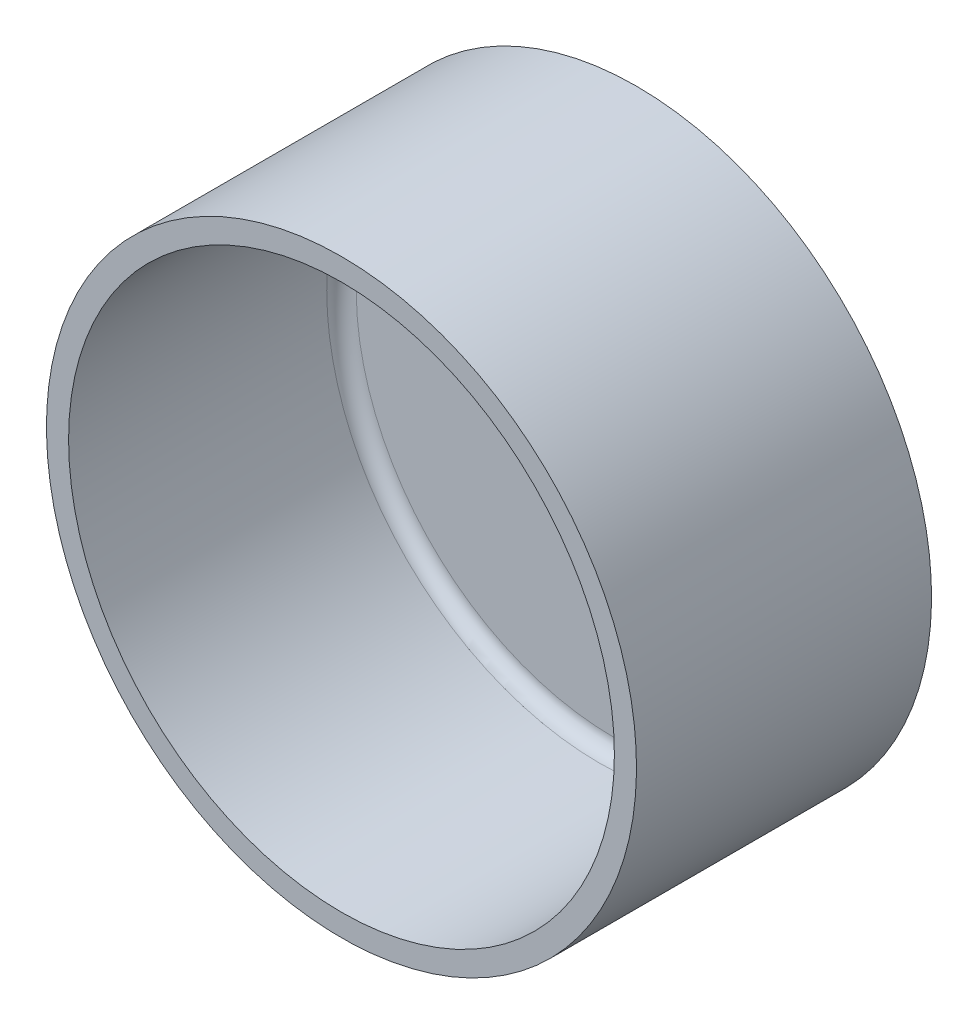
ISO-10303-21;
HEADER;
FILE_DESCRIPTION(('STEP AP214'),'2;1');
FILE_NAME('part.step','',(''),(''),'','','');
FILE_SCHEMA(('AUTOMOTIVE_DESIGN { 1 0 10303 214 1 1 1 1 }'));
ENDSEC;
DATA;
#1=APPLICATION_CONTEXT('core data for automotive mechanical design processes');
#2=APPLICATION_PROTOCOL_DEFINITION('international standard','automotive_design',2000,#1);
#3=PRODUCT_CONTEXT('',#1,'mechanical');
#4=PRODUCT('Part','Part','',(#3));
#5=PRODUCT_RELATED_PRODUCT_CATEGORY('part','',(#4));
#6=PRODUCT_DEFINITION_FORMATION('','',#4);
#7=PRODUCT_DEFINITION_CONTEXT('part definition',#1,'design');
#8=PRODUCT_DEFINITION('design','',#6,#7);
#9=PRODUCT_DEFINITION_SHAPE('','',#8);
#10=(LENGTH_UNIT() NAMED_UNIT(*) SI_UNIT(.MILLI.,.METRE.));
#11=(NAMED_UNIT(*) PLANE_ANGLE_UNIT() SI_UNIT($,.RADIAN.));
#12=(NAMED_UNIT(*) SI_UNIT($,.STERADIAN.) SOLID_ANGLE_UNIT());
#13=UNCERTAINTY_MEASURE_WITH_UNIT(LENGTH_MEASURE(1.E-05),#10,'distance_accuracy_value','');
#14=(GEOMETRIC_REPRESENTATION_CONTEXT(3) GLOBAL_UNCERTAINTY_ASSIGNED_CONTEXT((#13)) GLOBAL_UNIT_ASSIGNED_CONTEXT((#10,
#11,#12)) REPRESENTATION_CONTEXT('',''));
#15=CARTESIAN_POINT('',(0.,0.,0.));
#16=DIRECTION('',(0.,0.,1.));
#17=DIRECTION('',(1.,0.,0.));
#18=AXIS2_PLACEMENT_3D('',#15,#16,#17);
#19=CARTESIAN_POINT('',(0.,18.5,0.));
#20=DIRECTION('',(0.,0.,1.));
#21=DIRECTION('',(0.,-1.,0.));
#22=AXIS2_PLACEMENT_3D('',#19,#20,#21);
#23=PLANE('',#22);
#24=CARTESIAN_POINT('',(0.,0.,0.));
#25=DIRECTION('',(0.,0.,-1.));
#26=DIRECTION('',(0.,1.,0.));
#27=AXIS2_PLACEMENT_3D('',#24,#25,#26);
#28=CIRCLE('',#27,18.5);
#29=CARTESIAN_POINT('',(0.,18.5,0.));
#30=VERTEX_POINT('',#29);
#31=EDGE_CURVE('E131',#30,#30,#28,.T.);
#32=ORIENTED_EDGE('',*,*,#31,.T.);
#33=EDGE_LOOP('',(#32));
#34=FACE_BOUND('',#33,.T.);
#35=CARTESIAN_POINT('',(0.,0.,0.));
#36=DIRECTION('',(0.,0.,-1.));
#37=DIRECTION('',(0.,1.,0.));
#38=AXIS2_PLACEMENT_3D('',#35,#36,#37);
#39=CIRCLE('',#38,20.);
#40=CARTESIAN_POINT('',(0.,20.,0.));
#41=VERTEX_POINT('',#40);
#42=EDGE_CURVE('E122',#41,#41,#39,.T.);
#43=ORIENTED_EDGE('',*,*,#42,.F.);
#44=EDGE_LOOP('',(#43));
#45=FACE_BOUND('',#44,.T.);
#46=ADVANCED_FACE('F111',(#34,#45),#23,.T.);
#47=CARTESIAN_POINT('',(0.,0.,-20.));
#48=DIRECTION('',(0.,0.,-1.));
#49=DIRECTION('',(0.,1.,0.));
#50=AXIS2_PLACEMENT_3D('',#47,#48,#49);
#51=CYLINDRICAL_SURFACE('',#50,20.);
#52=ORIENTED_EDGE('',*,*,#42,.T.);
#53=EDGE_LOOP('',(#52));
#54=FACE_BOUND('',#53,.T.);
#55=CARTESIAN_POINT('',(0.,0.,-20.));
#56=DIRECTION('',(0.,0.,-1.));
#57=DIRECTION('',(0.,1.,0.));
#58=AXIS2_PLACEMENT_3D('',#55,#56,#57);
#59=CIRCLE('',#58,20.);
#60=CARTESIAN_POINT('',(0.,20.,-20.));
#61=VERTEX_POINT('',#60);
#62=EDGE_CURVE('E126',#61,#61,#59,.T.);
#63=ORIENTED_EDGE('',*,*,#62,.F.);
#64=EDGE_LOOP('',(#63));
#65=FACE_BOUND('',#64,.T.);
#66=ADVANCED_FACE('F179',(#54,#65),#51,.T.);
#67=CARTESIAN_POINT('',(0.,20.,-20.));
#68=DIRECTION('',(0.,0.,-1.));
#69=DIRECTION('',(0.,1.,0.));
#70=AXIS2_PLACEMENT_3D('',#67,#68,#69);
#71=PLANE('',#70);
#72=CARTESIAN_POINT('',(0.,-4.99999999999999,-20.));
#73=DIRECTION('',(0.,0.,-1.));
#74=DIRECTION('',(0.,1.,0.));
#75=AXIS2_PLACEMENT_3D('',#72,#73,#74);
#76=CIRCLE('',#75,1.);
#77=CARTESIAN_POINT('',(0.,-3.99999999999999,-20.));
#78=VERTEX_POINT('',#77);
#79=EDGE_CURVE('E140',#78,#78,#76,.T.);
#80=ORIENTED_EDGE('',*,*,#79,.F.);
#81=EDGE_LOOP('',(#80));
#82=FACE_BOUND('',#81,.T.);
#83=CARTESIAN_POINT('',(0.,0.,-20.));
#84=DIRECTION('',(0.,0.,-1.));
#85=DIRECTION('',(0.,1.,0.));
#86=AXIS2_PLACEMENT_3D('',#83,#84,#85);
#87=CIRCLE('',#86,1.5);
#88=CARTESIAN_POINT('',(0.,1.5,-20.));
#89=VERTEX_POINT('',#88);
#90=EDGE_CURVE('E143',#89,#89,#87,.T.);
#91=ORIENTED_EDGE('',*,*,#90,.F.);
#92=EDGE_LOOP('',(#91));
#93=FACE_BOUND('',#92,.T.);
#94=CARTESIAN_POINT('',(0.,5.00000000000001,-20.));
#95=DIRECTION('',(0.,0.,-1.));
#96=DIRECTION('',(0.,1.,0.));
#97=AXIS2_PLACEMENT_3D('',#94,#95,#96);
#98=CIRCLE('',#97,1.);
#99=CARTESIAN_POINT('',(0.,6.00000000000001,-20.));
#100=VERTEX_POINT('',#99);
#101=EDGE_CURVE('E134',#100,#100,#98,.T.);
#102=ORIENTED_EDGE('',*,*,#101,.F.);
#103=EDGE_LOOP('',(#102));
#104=FACE_BOUND('',#103,.T.);
#105=ORIENTED_EDGE('',*,*,#62,.T.);
#106=EDGE_LOOP('',(#105));
#107=FACE_BOUND('',#106,.T.);
#108=ADVANCED_FACE('F159',(#82,#93,#104,#107),#71,.T.);
#109=CARTESIAN_POINT('',(0.,18.5,-18.5));
#110=DIRECTION('',(0.,0.,1.));
#111=DIRECTION('',(0.,-1.,0.));
#112=AXIS2_PLACEMENT_3D('',#109,#110,#111);
#113=PLANE('',#112);
#114=CARTESIAN_POINT('',(0.,-4.99999999999999,-18.5));
#115=DIRECTION('',(0.,0.,1.));
#116=DIRECTION('',(1.,0.,0.));
#117=AXIS2_PLACEMENT_3D('',#114,#115,#116);
#118=CIRCLE('',#117,1.);
#119=CARTESIAN_POINT('',(1.,-4.99999999999999,-18.5));
#120=VERTEX_POINT('',#119);
#121=EDGE_CURVE('E146',#120,#120,#118,.T.);
#122=ORIENTED_EDGE('',*,*,#121,.F.);
#123=EDGE_LOOP('',(#122));
#124=FACE_BOUND('',#123,.T.);
#125=CARTESIAN_POINT('',(0.,0.,-18.5));
#126=DIRECTION('',(0.,0.,1.));
#127=DIRECTION('',(1.,0.,0.));
#128=AXIS2_PLACEMENT_3D('',#125,#126,#127);
#129=CIRCLE('',#128,1.5);
#130=CARTESIAN_POINT('',(1.5,0.,-18.5));
#131=VERTEX_POINT('',#130);
#132=EDGE_CURVE('E147',#131,#131,#129,.T.);
#133=ORIENTED_EDGE('',*,*,#132,.F.);
#134=EDGE_LOOP('',(#133));
#135=FACE_BOUND('',#134,.T.);
#136=CARTESIAN_POINT('',(0.,5.00000000000001,-18.5));
#137=DIRECTION('',(0.,0.,1.));
#138=DIRECTION('',(1.,0.,0.));
#139=AXIS2_PLACEMENT_3D('',#136,#137,#138);
#140=CIRCLE('',#139,1.);
#141=CARTESIAN_POINT('',(1.,5.00000000000001,-18.5));
#142=VERTEX_POINT('',#141);
#143=EDGE_CURVE('E137',#142,#142,#140,.T.);
#144=ORIENTED_EDGE('',*,*,#143,.F.);
#145=EDGE_LOOP('',(#144));
#146=FACE_BOUND('',#145,.T.);
#147=CARTESIAN_POINT('',(0.,0.,-18.5));
#148=DIRECTION('',(0.,0.,1.));
#149=DIRECTION('',(0.,-1.,0.));
#150=AXIS2_PLACEMENT_3D('',#147,#148,#149);
#151=CIRCLE('',#150,17.5);
#152=CARTESIAN_POINT('',(0.,-17.5,-18.5));
#153=VERTEX_POINT('',#152);
#154=EDGE_CURVE('E11',#153,#153,#151,.T.);
#155=ORIENTED_EDGE('',*,*,#154,.T.);
#156=EDGE_LOOP('',(#155));
#157=FACE_BOUND('',#156,.T.);
#158=ADVANCED_FACE('F155',(#124,#135,#146,#157),#113,.T.);
#159=CARTESIAN_POINT('',(0.,0.,-20.));
#160=DIRECTION('',(0.,0.,-1.));
#161=DIRECTION('',(0.,1.,0.));
#162=AXIS2_PLACEMENT_3D('',#159,#160,#161);
#163=CYLINDRICAL_SURFACE('',#162,18.5);
#164=CARTESIAN_POINT('',(0.,0.,-17.5));
#165=DIRECTION('',(0.,0.,1.));
#166=DIRECTION('',(0.,-1.,0.));
#167=AXIS2_PLACEMENT_3D('',#164,#165,#166);
#168=CIRCLE('',#167,18.5);
#169=CARTESIAN_POINT('',(0.,-18.5,-17.5));
#170=VERTEX_POINT('',#169);
#171=EDGE_CURVE('E118',#170,#170,#168,.F.);
#172=ORIENTED_EDGE('',*,*,#171,.T.);
#173=EDGE_LOOP('',(#172));
#174=FACE_BOUND('',#173,.T.);
#175=ORIENTED_EDGE('',*,*,#31,.F.);
#176=EDGE_LOOP('',(#175));
#177=FACE_BOUND('',#176,.T.);
#178=ADVANCED_FACE('F158',(#174,#177),#163,.F.);
#179=CARTESIAN_POINT('',(0.,0.,-17.5));
#180=DIRECTION('',(0.,0.,1.));
#181=DIRECTION('',(0.,-1.,0.));
#182=AXIS2_PLACEMENT_3D('',#179,#180,#181);
#183=TOROIDAL_SURFACE('',#182,17.5,1.);
#184=ORIENTED_EDGE('',*,*,#154,.F.);
#185=EDGE_LOOP('',(#184));
#186=FACE_BOUND('',#185,.T.);
#187=ORIENTED_EDGE('',*,*,#171,.F.);
#188=EDGE_LOOP('',(#187));
#189=FACE_BOUND('',#188,.T.);
#190=ADVANCED_FACE('F113',(#186,#189),#183,.F.);
#191=CARTESIAN_POINT('',(0.,5.00000000000001,-28.5));
#192=DIRECTION('',(0.,0.,1.));
#193=DIRECTION('',(1.,0.,0.));
#194=AXIS2_PLACEMENT_3D('',#191,#192,#193);
#195=CYLINDRICAL_SURFACE('',#194,1.);
#196=ORIENTED_EDGE('',*,*,#101,.T.);
#197=EDGE_LOOP('',(#196));
#198=FACE_BOUND('',#197,.T.);
#199=ORIENTED_EDGE('',*,*,#143,.T.);
#200=EDGE_LOOP('',(#199));
#201=FACE_BOUND('',#200,.T.);
#202=ADVANCED_FACE('F165',(#198,#201),#195,.F.);
#203=CARTESIAN_POINT('',(0.,0.,-28.5));
#204=DIRECTION('',(0.,0.,1.));
#205=DIRECTION('',(1.,0.,0.));
#206=AXIS2_PLACEMENT_3D('',#203,#204,#205);
#207=CYLINDRICAL_SURFACE('',#206,1.5);
#208=ORIENTED_EDGE('',*,*,#90,.T.);
#209=EDGE_LOOP('',(#208));
#210=FACE_BOUND('',#209,.T.);
#211=ORIENTED_EDGE('',*,*,#132,.T.);
#212=EDGE_LOOP('',(#211));
#213=FACE_BOUND('',#212,.T.);
#214=ADVANCED_FACE('F167',(#210,#213),#207,.F.);
#215=CARTESIAN_POINT('',(0.,-4.99999999999999,-28.5));
#216=DIRECTION('',(0.,0.,1.));
#217=DIRECTION('',(1.,0.,0.));
#218=AXIS2_PLACEMENT_3D('',#215,#216,#217);
#219=CYLINDRICAL_SURFACE('',#218,1.);
#220=ORIENTED_EDGE('',*,*,#79,.T.);
#221=EDGE_LOOP('',(#220));
#222=FACE_BOUND('',#221,.T.);
#223=ORIENTED_EDGE('',*,*,#121,.T.);
#224=EDGE_LOOP('',(#223));
#225=FACE_BOUND('',#224,.T.);
#226=ADVANCED_FACE('F153',(#222,#225),#219,.F.);
#227=CLOSED_SHELL('',(#46,#66,#108,#158,#178,#190,#202,#214,#226));
#228=MANIFOLD_SOLID_BREP('B2',#227);
#229=ADVANCED_BREP_SHAPE_REPRESENTATION('',(#18,#228),#14);
#230=SHAPE_DEFINITION_REPRESENTATION(#9,#229);
ENDSEC;
END-ISO-10303-21;
